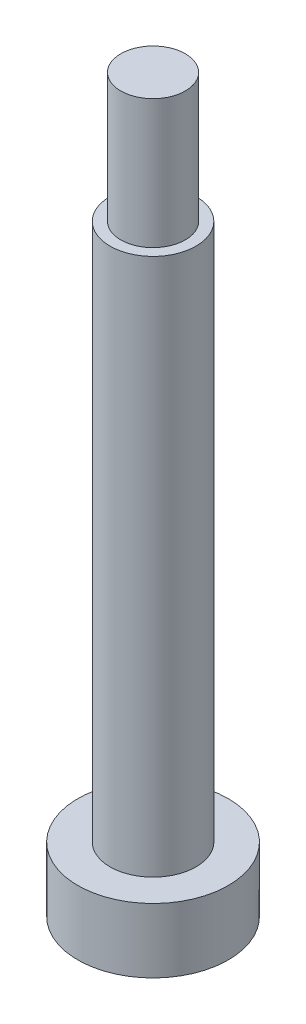
ISO-10303-21;
HEADER;
FILE_DESCRIPTION(('STEP AP214'),'2;1');
FILE_NAME('part.step','',(''),(''),'','','');
FILE_SCHEMA(('AUTOMOTIVE_DESIGN { 1 0 10303 214 1 1 1 1 }'));
ENDSEC;
DATA;
#1=APPLICATION_CONTEXT('core data for automotive mechanical design processes');
#2=APPLICATION_PROTOCOL_DEFINITION('international standard','automotive_design',2000,#1);
#3=PRODUCT_CONTEXT('',#1,'mechanical');
#4=PRODUCT('Part','Part','',(#3));
#5=PRODUCT_RELATED_PRODUCT_CATEGORY('part','',(#4));
#6=PRODUCT_DEFINITION_FORMATION('','',#4);
#7=PRODUCT_DEFINITION_CONTEXT('part definition',#1,'design');
#8=PRODUCT_DEFINITION('design','',#6,#7);
#9=PRODUCT_DEFINITION_SHAPE('','',#8);
#10=(LENGTH_UNIT() NAMED_UNIT(*) SI_UNIT(.MILLI.,.METRE.));
#11=(NAMED_UNIT(*) PLANE_ANGLE_UNIT() SI_UNIT($,.RADIAN.));
#12=(NAMED_UNIT(*) SI_UNIT($,.STERADIAN.) SOLID_ANGLE_UNIT());
#13=UNCERTAINTY_MEASURE_WITH_UNIT(LENGTH_MEASURE(1.E-05),#10,'distance_accuracy_value','');
#14=(GEOMETRIC_REPRESENTATION_CONTEXT(3) GLOBAL_UNCERTAINTY_ASSIGNED_CONTEXT((#13)) GLOBAL_UNIT_ASSIGNED_CONTEXT((#10,
#11,#12)) REPRESENTATION_CONTEXT('',''));
#15=CARTESIAN_POINT('',(0.,0.,0.));
#16=DIRECTION('',(0.,0.,1.));
#17=DIRECTION('',(1.,0.,0.));
#18=AXIS2_PLACEMENT_3D('',#15,#16,#17);
#19=CARTESIAN_POINT('',(0.,25.,0.));
#20=DIRECTION('',(0.,-1.,0.));
#21=DIRECTION('',(0.,0.,-1.));
#22=AXIS2_PLACEMENT_3D('',#19,#20,#21);
#23=CYLINDRICAL_SURFACE('',#22,2.);
#24=CARTESIAN_POINT('',(0.,25.,0.));
#25=DIRECTION('',(0.,1.,0.));
#26=DIRECTION('',(0.,0.,1.));
#27=AXIS2_PLACEMENT_3D('',#24,#25,#26);
#28=CIRCLE('',#27,2.);
#29=CARTESIAN_POINT('',(0.,25.,2.));
#30=VERTEX_POINT('',#29);
#31=EDGE_CURVE('E44',#30,#30,#28,.T.);
#32=ORIENTED_EDGE('',*,*,#31,.F.);
#33=EDGE_LOOP('',(#32));
#34=FACE_BOUND('',#33,.T.);
#35=CARTESIAN_POINT('',(0.,0.,0.));
#36=DIRECTION('',(0.,1.,0.));
#37=DIRECTION('',(0.,0.,1.));
#38=AXIS2_PLACEMENT_3D('',#35,#36,#37);
#39=CIRCLE('',#38,2.);
#40=CARTESIAN_POINT('',(0.,0.,2.));
#41=VERTEX_POINT('',#40);
#42=EDGE_CURVE('E40',#41,#41,#39,.T.);
#43=ORIENTED_EDGE('',*,*,#42,.T.);
#44=EDGE_LOOP('',(#43));
#45=FACE_BOUND('',#44,.T.);
#46=ADVANCED_FACE('F37',(#34,#45),#23,.T.);
#47=CARTESIAN_POINT('',(0.,25.,0.));
#48=DIRECTION('',(0.,1.,0.));
#49=DIRECTION('',(0.,0.,1.));
#50=AXIS2_PLACEMENT_3D('',#47,#48,#49);
#51=PLANE('',#50);
#52=CARTESIAN_POINT('',(0.,25.,0.));
#53=DIRECTION('',(0.,1.,0.));
#54=DIRECTION('',(0.,0.,1.));
#55=AXIS2_PLACEMENT_3D('',#52,#53,#54);
#56=CIRCLE('',#55,1.5);
#57=CARTESIAN_POINT('',(0.,25.,1.5));
#58=VERTEX_POINT('',#57);
#59=EDGE_CURVE('E10',#58,#58,#56,.T.);
#60=ORIENTED_EDGE('',*,*,#59,.F.);
#61=EDGE_LOOP('',(#60));
#62=FACE_BOUND('',#61,.T.);
#63=ORIENTED_EDGE('',*,*,#31,.T.);
#64=EDGE_LOOP('',(#63));
#65=FACE_BOUND('',#64,.T.);
#66=ADVANCED_FACE('F85',(#62,#65),#51,.T.);
#67=CARTESIAN_POINT('',(0.,31.,0.));
#68=DIRECTION('',(0.,-1.,0.));
#69=DIRECTION('',(0.,0.,-1.));
#70=AXIS2_PLACEMENT_3D('',#67,#68,#69);
#71=CYLINDRICAL_SURFACE('',#70,1.5);
#72=CARTESIAN_POINT('',(0.,31.,0.));
#73=DIRECTION('',(0.,1.,0.));
#74=DIRECTION('',(0.,0.,1.));
#75=AXIS2_PLACEMENT_3D('',#72,#73,#74);
#76=CIRCLE('',#75,1.5);
#77=CARTESIAN_POINT('',(0.,31.,1.5));
#78=VERTEX_POINT('',#77);
#79=EDGE_CURVE('E49',#78,#78,#76,.T.);
#80=ORIENTED_EDGE('',*,*,#79,.F.);
#81=EDGE_LOOP('',(#80));
#82=FACE_BOUND('',#81,.T.);
#83=ORIENTED_EDGE('',*,*,#59,.T.);
#84=EDGE_LOOP('',(#83));
#85=FACE_BOUND('',#84,.T.);
#86=ADVANCED_FACE('F81',(#82,#85),#71,.T.);
#87=CARTESIAN_POINT('',(0.,31.,0.));
#88=DIRECTION('',(0.,1.,0.));
#89=DIRECTION('',(0.,0.,1.));
#90=AXIS2_PLACEMENT_3D('',#87,#88,#89);
#91=PLANE('',#90);
#92=ORIENTED_EDGE('',*,*,#79,.T.);
#93=EDGE_LOOP('',(#92));
#94=FACE_BOUND('',#93,.T.);
#95=ADVANCED_FACE('F73',(#94),#91,.T.);
#96=CARTESIAN_POINT('',(0.,-3.,0.));
#97=DIRECTION('',(0.,1.,0.));
#98=DIRECTION('',(0.,0.,1.));
#99=AXIS2_PLACEMENT_3D('',#96,#97,#98);
#100=CYLINDRICAL_SURFACE('',#99,3.5);
#101=CARTESIAN_POINT('',(0.,-3.,0.));
#102=DIRECTION('',(0.,-1.,0.));
#103=DIRECTION('',(0.,0.,-1.));
#104=AXIS2_PLACEMENT_3D('',#101,#102,#103);
#105=CIRCLE('',#104,3.5);
#106=CARTESIAN_POINT('',(0.,-3.,-3.5));
#107=VERTEX_POINT('',#106);
#108=EDGE_CURVE('E56',#107,#107,#105,.T.);
#109=ORIENTED_EDGE('',*,*,#108,.F.);
#110=EDGE_LOOP('',(#109));
#111=FACE_BOUND('',#110,.T.);
#112=CARTESIAN_POINT('',(0.,0.,0.));
#113=DIRECTION('',(0.,-1.,0.));
#114=DIRECTION('',(0.,0.,-1.));
#115=AXIS2_PLACEMENT_3D('',#112,#113,#114);
#116=CIRCLE('',#115,3.5);
#117=CARTESIAN_POINT('',(0.,0.,-3.5));
#118=VERTEX_POINT('',#117);
#119=EDGE_CURVE('E53',#118,#118,#116,.T.);
#120=ORIENTED_EDGE('',*,*,#119,.T.);
#121=EDGE_LOOP('',(#120));
#122=FACE_BOUND('',#121,.T.);
#123=ADVANCED_FACE('F71',(#111,#122),#100,.T.);
#124=CARTESIAN_POINT('',(0.,-3.,0.));
#125=DIRECTION('',(0.,-1.,0.));
#126=DIRECTION('',(0.,0.,-1.));
#127=AXIS2_PLACEMENT_3D('',#124,#125,#126);
#128=PLANE('',#127);
#129=ORIENTED_EDGE('',*,*,#108,.T.);
#130=EDGE_LOOP('',(#129));
#131=FACE_BOUND('',#130,.T.);
#132=ADVANCED_FACE('F67',(#131),#128,.T.);
#133=CARTESIAN_POINT('',(0.,0.,0.));
#134=DIRECTION('',(0.,-1.,0.));
#135=DIRECTION('',(0.,0.,-1.));
#136=AXIS2_PLACEMENT_3D('',#133,#134,#135);
#137=PLANE('',#136);
#138=ORIENTED_EDGE('',*,*,#42,.F.);
#139=EDGE_LOOP('',(#138));
#140=FACE_BOUND('',#139,.T.);
#141=ORIENTED_EDGE('',*,*,#119,.F.);
#142=EDGE_LOOP('',(#141));
#143=FACE_BOUND('',#142,.T.);
#144=ADVANCED_FACE('F64',(#140,#143),#137,.F.);
#145=CLOSED_SHELL('',(#46,#66,#86,#95,#123,#132,#144));
#146=MANIFOLD_SOLID_BREP('B2',#145);
#147=ADVANCED_BREP_SHAPE_REPRESENTATION('',(#18,#146),#14);
#148=SHAPE_DEFINITION_REPRESENTATION(#9,#147);
ENDSEC;
END-ISO-10303-21;
